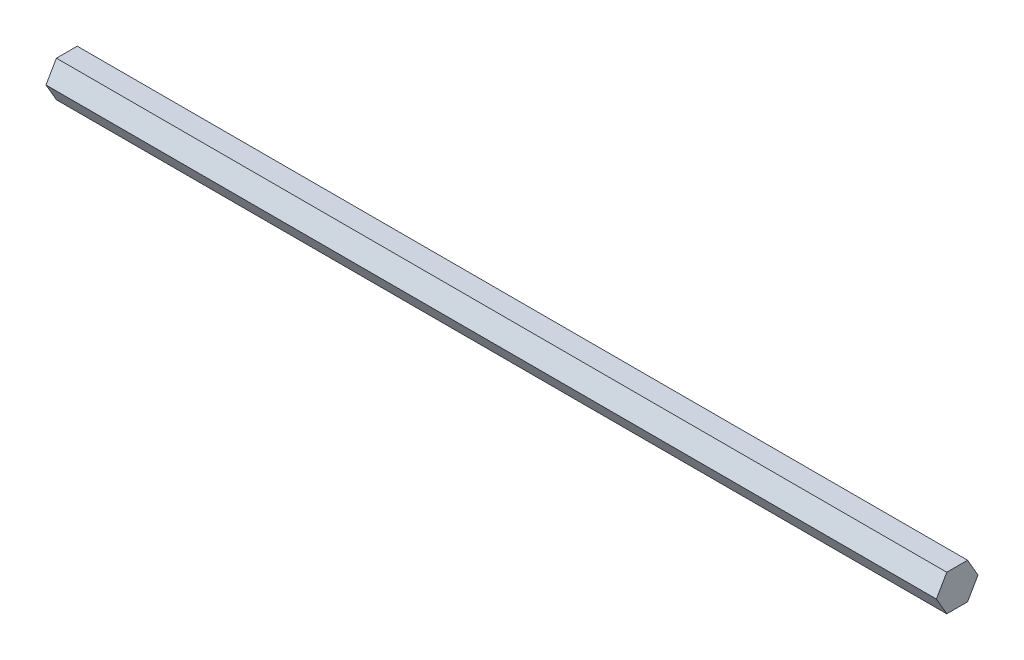
ISO-10303-21;
HEADER;
FILE_DESCRIPTION(('STEP AP214'),'2;1');
FILE_NAME('part.step','',(''),(''),'','','');
FILE_SCHEMA(('AUTOMOTIVE_DESIGN { 1 0 10303 214 1 1 1 1 }'));
ENDSEC;
DATA;
#1=APPLICATION_CONTEXT('core data for automotive mechanical design processes');
#2=APPLICATION_PROTOCOL_DEFINITION('international standard','automotive_design',2000,#1);
#3=PRODUCT_CONTEXT('',#1,'mechanical');
#4=PRODUCT('Part','Part','',(#3));
#5=PRODUCT_RELATED_PRODUCT_CATEGORY('part','',(#4));
#6=PRODUCT_DEFINITION_FORMATION('','',#4);
#7=PRODUCT_DEFINITION_CONTEXT('part definition',#1,'design');
#8=PRODUCT_DEFINITION('design','',#6,#7);
#9=PRODUCT_DEFINITION_SHAPE('','',#8);
#10=(LENGTH_UNIT() NAMED_UNIT(*) SI_UNIT(.MILLI.,.METRE.));
#11=(NAMED_UNIT(*) PLANE_ANGLE_UNIT() SI_UNIT($,.RADIAN.));
#12=(NAMED_UNIT(*) SI_UNIT($,.STERADIAN.) SOLID_ANGLE_UNIT());
#13=UNCERTAINTY_MEASURE_WITH_UNIT(LENGTH_MEASURE(1.E-05),#10,'distance_accuracy_value','');
#14=(GEOMETRIC_REPRESENTATION_CONTEXT(3) GLOBAL_UNCERTAINTY_ASSIGNED_CONTEXT((#13)) GLOBAL_UNIT_ASSIGNED_CONTEXT((#10,
#11,#12)) REPRESENTATION_CONTEXT('',''));
#15=CARTESIAN_POINT('',(0.,0.,0.));
#16=DIRECTION('',(0.,0.,1.));
#17=DIRECTION('',(1.,0.,0.));
#18=AXIS2_PLACEMENT_3D('',#15,#16,#17);
#19=CARTESIAN_POINT('',(313.7,-6.34999999999996,-3.6661742093542));
#20=DIRECTION('',(0.,0.499999999999995,0.866025403784442));
#21=DIRECTION('',(0.,-0.866025403784442,0.499999999999995));
#22=AXIS2_PLACEMENT_3D('',#19,#20,#21);
#23=PLANE('',#22);
#24=DIRECTION('',(0.,0.866025403784442,-0.499999999999995));
#25=VECTOR('',#24,1.);
#26=CARTESIAN_POINT('',(0.,-6.34999999999996,-3.6661742093542));
#27=LINE('',#26,#25);
#28=CARTESIAN_POINT('',(0.,-6.34999999999996,-3.6661742093542));
#29=VERTEX_POINT('',#28);
#30=CARTESIAN_POINT('',(0.,0.,-7.33234841870825));
#31=VERTEX_POINT('',#30);
#32=EDGE_CURVE('E123',#29,#31,#27,.T.);
#33=ORIENTED_EDGE('',*,*,#32,.T.);
#34=DIRECTION('',(-1.,0.,0.));
#35=VECTOR('',#34,1.);
#36=CARTESIAN_POINT('',(313.7,0.,-7.33234841870825));
#37=LINE('',#36,#35);
#38=CARTESIAN_POINT('',(313.7,0.,-7.33234841870825));
#39=VERTEX_POINT('',#38);
#40=EDGE_CURVE('E11',#39,#31,#37,.T.);
#41=ORIENTED_EDGE('',*,*,#40,.F.);
#42=DIRECTION('',(0.,0.866025403784442,-0.499999999999995));
#43=VECTOR('',#42,1.);
#44=CARTESIAN_POINT('',(313.7,-6.34999999999996,-3.6661742093542));
#45=LINE('',#44,#43);
#46=CARTESIAN_POINT('',(313.7,-6.34999999999996,-3.6661742093542));
#47=VERTEX_POINT('',#46);
#48=EDGE_CURVE('E133',#47,#39,#45,.T.);
#49=ORIENTED_EDGE('',*,*,#48,.F.);
#50=DIRECTION('',(-1.,0.,0.));
#51=VECTOR('',#50,1.);
#52=CARTESIAN_POINT('',(313.7,-6.34999999999996,-3.6661742093542));
#53=LINE('',#52,#51);
#54=EDGE_CURVE('E119',#47,#29,#53,.T.);
#55=ORIENTED_EDGE('',*,*,#54,.T.);
#56=EDGE_LOOP('',(#33,#41,#49,#55));
#57=FACE_BOUND('',#56,.T.);
#58=ADVANCED_FACE('F39',(#57),#23,.F.);
#59=CARTESIAN_POINT('',(313.7,0.,-7.33234841870825));
#60=DIRECTION('',(0.,-0.500000000000001,0.866025403784438));
#61=DIRECTION('',(0.,-0.866025403784438,-0.500000000000001));
#62=AXIS2_PLACEMENT_3D('',#59,#60,#61);
#63=PLANE('',#62);
#64=DIRECTION('',(0.,0.866025403784438,0.500000000000001));
#65=VECTOR('',#64,1.);
#66=CARTESIAN_POINT('',(0.,0.,-7.33234841870825));
#67=LINE('',#66,#65);
#68=CARTESIAN_POINT('',(0.,6.35000000000001,-3.66617420935411));
#69=VERTEX_POINT('',#68);
#70=EDGE_CURVE('E126',#31,#69,#67,.T.);
#71=ORIENTED_EDGE('',*,*,#70,.T.);
#72=DIRECTION('',(-1.,0.,0.));
#73=VECTOR('',#72,1.);
#74=CARTESIAN_POINT('',(313.7,6.35000000000001,-3.66617420935411));
#75=LINE('',#74,#73);
#76=CARTESIAN_POINT('',(313.7,6.35000000000001,-3.66617420935411));
#77=VERTEX_POINT('',#76);
#78=EDGE_CURVE('E47',#77,#69,#75,.T.);
#79=ORIENTED_EDGE('',*,*,#78,.F.);
#80=DIRECTION('',(0.,0.866025403784438,0.500000000000001));
#81=VECTOR('',#80,1.);
#82=CARTESIAN_POINT('',(313.7,0.,-7.33234841870825));
#83=LINE('',#82,#81);
#84=EDGE_CURVE('E92',#39,#77,#83,.T.);
#85=ORIENTED_EDGE('',*,*,#84,.F.);
#86=ORIENTED_EDGE('',*,*,#40,.T.);
#87=EDGE_LOOP('',(#71,#79,#85,#86));
#88=FACE_BOUND('',#87,.T.);
#89=ADVANCED_FACE('F157',(#88),#63,.F.);
#90=CARTESIAN_POINT('',(313.7,6.35000000000001,-3.66617420935411));
#91=DIRECTION('',(0.,-1.,0.));
#92=DIRECTION('',(0.,0.,-1.));
#93=AXIS2_PLACEMENT_3D('',#90,#91,#92);
#94=PLANE('',#93);
#95=DIRECTION('',(0.,0.,1.));
#96=VECTOR('',#95,1.);
#97=CARTESIAN_POINT('',(0.,6.35000000000001,-3.66617420935411));
#98=LINE('',#97,#96);
#99=CARTESIAN_POINT('',(0.,6.34999999999999,3.66617420935415));
#100=VERTEX_POINT('',#99);
#101=EDGE_CURVE('E128',#69,#100,#98,.T.);
#102=ORIENTED_EDGE('',*,*,#101,.T.);
#103=DIRECTION('',(-1.,0.,0.));
#104=VECTOR('',#103,1.);
#105=CARTESIAN_POINT('',(313.7,6.34999999999999,3.66617420935415));
#106=LINE('',#105,#104);
#107=CARTESIAN_POINT('',(313.7,6.34999999999999,3.66617420935415));
#108=VERTEX_POINT('',#107);
#109=EDGE_CURVE('E114',#108,#100,#106,.T.);
#110=ORIENTED_EDGE('',*,*,#109,.F.);
#111=DIRECTION('',(0.,0.,1.));
#112=VECTOR('',#111,1.);
#113=CARTESIAN_POINT('',(313.7,6.35000000000001,-3.66617420935411));
#114=LINE('',#113,#112);
#115=EDGE_CURVE('E105',#77,#108,#114,.T.);
#116=ORIENTED_EDGE('',*,*,#115,.F.);
#117=ORIENTED_EDGE('',*,*,#78,.T.);
#118=EDGE_LOOP('',(#102,#110,#116,#117));
#119=FACE_BOUND('',#118,.T.);
#120=ADVANCED_FACE('F139',(#119),#94,.F.);
#121=CARTESIAN_POINT('',(313.7,6.34999999999999,3.66617420935415));
#122=DIRECTION('',(0.,-0.499999999999995,-0.866025403784442));
#123=DIRECTION('',(0.,0.866025403784442,-0.499999999999995));
#124=AXIS2_PLACEMENT_3D('',#121,#122,#123);
#125=PLANE('',#124);
#126=DIRECTION('',(0.,-0.866025403784442,0.499999999999995));
#127=VECTOR('',#126,1.);
#128=CARTESIAN_POINT('',(0.,6.34999999999999,3.66617420935415));
#129=LINE('',#128,#127);
#130=CARTESIAN_POINT('',(0.,0.,7.33234841870825));
#131=VERTEX_POINT('',#130);
#132=EDGE_CURVE('E113',#100,#131,#129,.T.);
#133=ORIENTED_EDGE('',*,*,#132,.T.);
#134=DIRECTION('',(-1.,0.,0.));
#135=VECTOR('',#134,1.);
#136=CARTESIAN_POINT('',(313.7,0.,7.33234841870825));
#137=LINE('',#136,#135);
#138=CARTESIAN_POINT('',(313.7,0.,7.33234841870825));
#139=VERTEX_POINT('',#138);
#140=EDGE_CURVE('E110',#139,#131,#137,.T.);
#141=ORIENTED_EDGE('',*,*,#140,.F.);
#142=DIRECTION('',(0.,-0.866025403784442,0.499999999999995));
#143=VECTOR('',#142,1.);
#144=CARTESIAN_POINT('',(313.7,6.34999999999999,3.66617420935415));
#145=LINE('',#144,#143);
#146=EDGE_CURVE('E99',#108,#139,#145,.T.);
#147=ORIENTED_EDGE('',*,*,#146,.F.);
#148=ORIENTED_EDGE('',*,*,#109,.T.);
#149=EDGE_LOOP('',(#133,#141,#147,#148));
#150=FACE_BOUND('',#149,.T.);
#151=ADVANCED_FACE('F111',(#150),#125,.F.);
#152=CARTESIAN_POINT('',(313.7,0.,7.33234841870825));
#153=DIRECTION('',(0.,0.500000000000007,-0.866025403784435));
#154=DIRECTION('',(0.,0.866025403784435,0.500000000000007));
#155=AXIS2_PLACEMENT_3D('',#152,#153,#154);
#156=PLANE('',#155);
#157=DIRECTION('',(0.,-0.866025403784434,-0.500000000000007));
#158=VECTOR('',#157,1.);
#159=CARTESIAN_POINT('',(0.,0.,7.33234841870825));
#160=LINE('',#159,#158);
#161=CARTESIAN_POINT('',(0.,-6.35000000000004,3.66617420935407));
#162=VERTEX_POINT('',#161);
#163=EDGE_CURVE('E78',#131,#162,#160,.T.);
#164=ORIENTED_EDGE('',*,*,#163,.T.);
#165=DIRECTION('',(-1.,0.,0.));
#166=VECTOR('',#165,1.);
#167=CARTESIAN_POINT('',(313.7,-6.35000000000004,3.66617420935407));
#168=LINE('',#167,#166);
#169=CARTESIAN_POINT('',(313.7,-6.35000000000004,3.66617420935407));
#170=VERTEX_POINT('',#169);
#171=EDGE_CURVE('E115',#170,#162,#168,.T.);
#172=ORIENTED_EDGE('',*,*,#171,.F.);
#173=DIRECTION('',(0.,-0.866025403784434,-0.500000000000007));
#174=VECTOR('',#173,1.);
#175=CARTESIAN_POINT('',(313.7,0.,7.33234841870825));
#176=LINE('',#175,#174);
#177=EDGE_CURVE('E103',#139,#170,#176,.T.);
#178=ORIENTED_EDGE('',*,*,#177,.F.);
#179=ORIENTED_EDGE('',*,*,#140,.T.);
#180=EDGE_LOOP('',(#164,#172,#178,#179));
#181=FACE_BOUND('',#180,.T.);
#182=ADVANCED_FACE('F117',(#181),#156,.F.);
#183=CARTESIAN_POINT('',(313.7,-6.35000000000004,3.66617420935407));
#184=DIRECTION('',(0.,1.,0.));
#185=DIRECTION('',(0.,0.,1.));
#186=AXIS2_PLACEMENT_3D('',#183,#184,#185);
#187=PLANE('',#186);
#188=DIRECTION('',(0.,0.,-1.));
#189=VECTOR('',#188,1.);
#190=CARTESIAN_POINT('',(0.,-6.35000000000004,3.66617420935407));
#191=LINE('',#190,#189);
#192=EDGE_CURVE('E84',#162,#29,#191,.T.);
#193=ORIENTED_EDGE('',*,*,#192,.T.);
#194=ORIENTED_EDGE('',*,*,#54,.F.);
#195=DIRECTION('',(0.,0.,-1.));
#196=VECTOR('',#195,1.);
#197=CARTESIAN_POINT('',(313.7,-6.35000000000004,3.66617420935407));
#198=LINE('',#197,#196);
#199=EDGE_CURVE('E55',#170,#47,#198,.T.);
#200=ORIENTED_EDGE('',*,*,#199,.F.);
#201=ORIENTED_EDGE('',*,*,#171,.T.);
#202=EDGE_LOOP('',(#193,#194,#200,#201));
#203=FACE_BOUND('',#202,.T.);
#204=ADVANCED_FACE('F146',(#203),#187,.F.);
#205=CARTESIAN_POINT('',(313.7,0.,0.));
#206=DIRECTION('',(1.,0.,0.));
#207=DIRECTION('',(0.,0.,-1.));
#208=AXIS2_PLACEMENT_3D('',#205,#206,#207);
#209=PLANE('',#208);
#210=ORIENTED_EDGE('',*,*,#48,.T.);
#211=ORIENTED_EDGE('',*,*,#84,.T.);
#212=ORIENTED_EDGE('',*,*,#115,.T.);
#213=ORIENTED_EDGE('',*,*,#146,.T.);
#214=ORIENTED_EDGE('',*,*,#177,.T.);
#215=ORIENTED_EDGE('',*,*,#199,.T.);
#216=EDGE_LOOP('',(#210,#211,#212,#213,#214,#215));
#217=FACE_BOUND('',#216,.T.);
#218=ADVANCED_FACE('F101',(#217),#209,.T.);
#219=CARTESIAN_POINT('',(0.,0.,0.));
#220=DIRECTION('',(1.,0.,0.));
#221=DIRECTION('',(0.,0.,-1.));
#222=AXIS2_PLACEMENT_3D('',#219,#220,#221);
#223=PLANE('',#222);
#224=ORIENTED_EDGE('',*,*,#32,.F.);
#225=ORIENTED_EDGE('',*,*,#192,.F.);
#226=ORIENTED_EDGE('',*,*,#163,.F.);
#227=ORIENTED_EDGE('',*,*,#132,.F.);
#228=ORIENTED_EDGE('',*,*,#101,.F.);
#229=ORIENTED_EDGE('',*,*,#70,.F.);
#230=EDGE_LOOP('',(#224,#225,#226,#227,#228,#229));
#231=FACE_BOUND('',#230,.T.);
#232=ADVANCED_FACE('F142',(#231),#223,.F.);
#233=CLOSED_SHELL('',(#58,#89,#120,#151,#182,#204,#218,#232));
#234=MANIFOLD_SOLID_BREP('B2',#233);
#235=ADVANCED_BREP_SHAPE_REPRESENTATION('',(#18,#234),#14);
#236=SHAPE_DEFINITION_REPRESENTATION(#9,#235);
ENDSEC;
END-ISO-10303-21;
